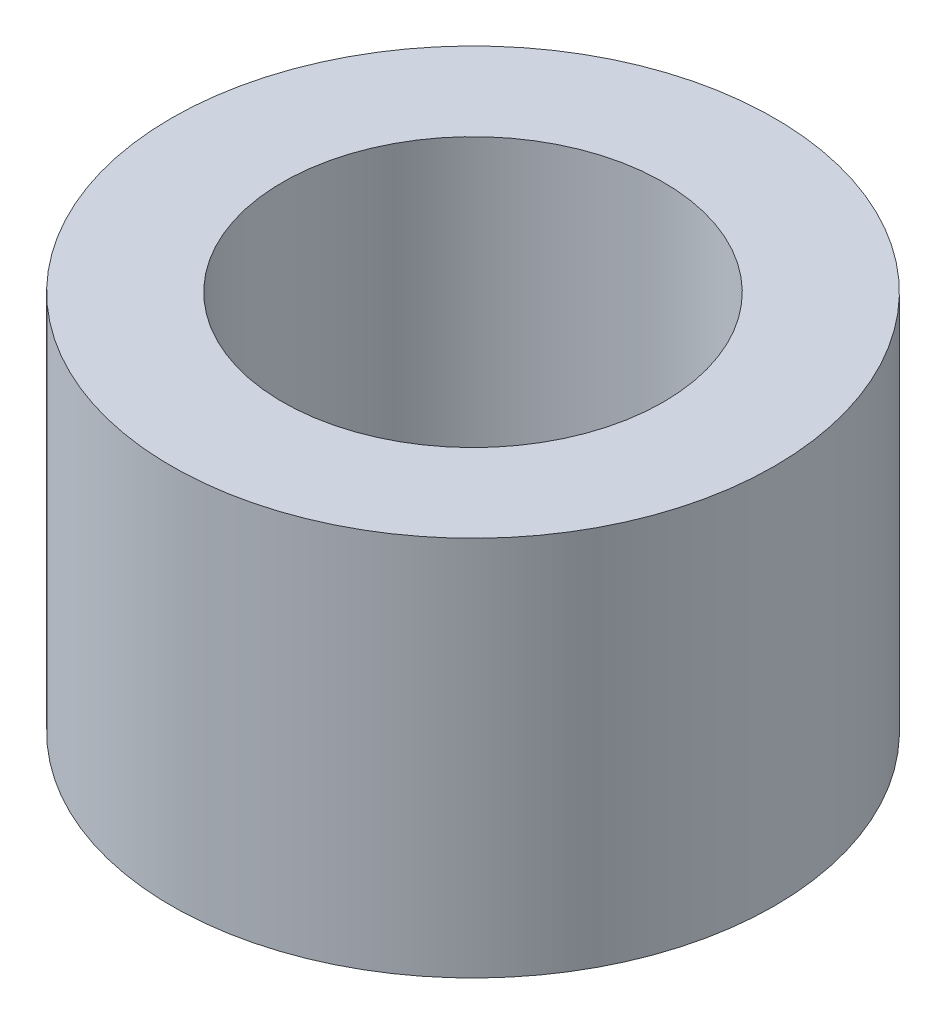
ISO-10303-21;
HEADER;
FILE_DESCRIPTION(('STEP AP214'),'2;1');
FILE_NAME('part.step','',(''),(''),'','','');
FILE_SCHEMA(('AUTOMOTIVE_DESIGN { 1 0 10303 214 1 1 1 1 }'));
ENDSEC;
DATA;
#1=APPLICATION_CONTEXT('core data for automotive mechanical design processes');
#2=APPLICATION_PROTOCOL_DEFINITION('international standard','automotive_design',2000,#1);
#3=PRODUCT_CONTEXT('',#1,'mechanical');
#4=PRODUCT('Part','Part','',(#3));
#5=PRODUCT_RELATED_PRODUCT_CATEGORY('part','',(#4));
#6=PRODUCT_DEFINITION_FORMATION('','',#4);
#7=PRODUCT_DEFINITION_CONTEXT('part definition',#1,'design');
#8=PRODUCT_DEFINITION('design','',#6,#7);
#9=PRODUCT_DEFINITION_SHAPE('','',#8);
#10=(LENGTH_UNIT() NAMED_UNIT(*) SI_UNIT(.MILLI.,.METRE.));
#11=(NAMED_UNIT(*) PLANE_ANGLE_UNIT() SI_UNIT($,.RADIAN.));
#12=(NAMED_UNIT(*) SI_UNIT($,.STERADIAN.) SOLID_ANGLE_UNIT());
#13=UNCERTAINTY_MEASURE_WITH_UNIT(LENGTH_MEASURE(1.E-05),#10,'distance_accuracy_value','');
#14=(GEOMETRIC_REPRESENTATION_CONTEXT(3) GLOBAL_UNCERTAINTY_ASSIGNED_CONTEXT((#13)) GLOBAL_UNIT_ASSIGNED_CONTEXT((#10,
#11,#12)) REPRESENTATION_CONTEXT('',''));
#15=CARTESIAN_POINT('',(0.,0.,0.));
#16=DIRECTION('',(0.,0.,1.));
#17=DIRECTION('',(1.,0.,0.));
#18=AXIS2_PLACEMENT_3D('',#15,#16,#17);
#19=CARTESIAN_POINT('',(0.,10.4,0.));
#20=DIRECTION('',(0.,1.,0.));
#21=DIRECTION('',(1.,0.,0.));
#22=AXIS2_PLACEMENT_3D('',#19,#20,#21);
#23=PLANE('',#22);
#24=CARTESIAN_POINT('',(0.,10.4,0.));
#25=DIRECTION('',(0.,1.,0.));
#26=DIRECTION('',(-1.,0.,0.));
#27=AXIS2_PLACEMENT_3D('',#24,#25,#26);
#28=CIRCLE('',#27,3.);
#29=CARTESIAN_POINT('',(3.,10.4,0.));
#30=VERTEX_POINT('',#29);
#31=EDGE_CURVE('E57',#30,#30,#28,.T.);
#32=ORIENTED_EDGE('',*,*,#31,.T.);
#33=EDGE_LOOP('',(#32));
#34=FACE_BOUND('',#33,.T.);
#35=CARTESIAN_POINT('',(0.,10.4,0.));
#36=DIRECTION('',(0.,-1.,0.));
#37=DIRECTION('',(-1.,0.,0.));
#38=AXIS2_PLACEMENT_3D('',#35,#36,#37);
#39=CIRCLE('',#38,4.75);
#40=CARTESIAN_POINT('',(4.75,10.4,0.));
#41=VERTEX_POINT('',#40);
#42=EDGE_CURVE('E67',#41,#41,#39,.T.);
#43=ORIENTED_EDGE('',*,*,#42,.T.);
#44=EDGE_LOOP('',(#43));
#45=FACE_BOUND('',#44,.T.);
#46=ADVANCED_FACE('F15',(#34,#45),#23,.F.);
#47=CARTESIAN_POINT('',(0.,16.4,0.));
#48=DIRECTION('',(0.,1.,0.));
#49=DIRECTION('',(1.,0.,0.));
#50=AXIS2_PLACEMENT_3D('',#47,#48,#49);
#51=PLANE('',#50);
#52=CARTESIAN_POINT('',(0.,16.4,0.));
#53=DIRECTION('',(0.,-1.,0.));
#54=DIRECTION('',(-1.,0.,0.));
#55=AXIS2_PLACEMENT_3D('',#52,#53,#54);
#56=CIRCLE('',#55,3.);
#57=CARTESIAN_POINT('',(3.,16.4,0.));
#58=VERTEX_POINT('',#57);
#59=EDGE_CURVE('E58',#58,#58,#56,.T.);
#60=ORIENTED_EDGE('',*,*,#59,.T.);
#61=EDGE_LOOP('',(#60));
#62=FACE_BOUND('',#61,.T.);
#63=CARTESIAN_POINT('',(0.,16.4,0.));
#64=DIRECTION('',(0.,1.,0.));
#65=DIRECTION('',(-1.,0.,0.));
#66=AXIS2_PLACEMENT_3D('',#63,#64,#65);
#67=CIRCLE('',#66,4.75);
#68=CARTESIAN_POINT('',(4.75,16.4,0.));
#69=VERTEX_POINT('',#68);
#70=EDGE_CURVE('E10',#69,#69,#67,.T.);
#71=ORIENTED_EDGE('',*,*,#70,.T.);
#72=EDGE_LOOP('',(#71));
#73=FACE_BOUND('',#72,.T.);
#74=ADVANCED_FACE('F17',(#62,#73),#51,.T.);
#75=CARTESIAN_POINT('',(0.,16.4,0.));
#76=DIRECTION('',(0.,-1.,0.));
#77=DIRECTION('',(-1.,0.,0.));
#78=AXIS2_PLACEMENT_3D('',#75,#76,#77);
#79=CYLINDRICAL_SURFACE('',#78,4.75);
#80=ORIENTED_EDGE('',*,*,#42,.F.);
#81=DIRECTION('',(0.,1.,0.));
#82=VECTOR('',#81,1.);
#83=CARTESIAN_POINT('',(4.75,16.4,0.));
#84=LINE('',#83,#82);
#85=EDGE_CURVE('E19',#41,#69,#84,.T.);
#86=ORIENTED_EDGE('',*,*,#85,.T.);
#87=ORIENTED_EDGE('',*,*,#70,.F.);
#88=ORIENTED_EDGE('',*,*,#85,.F.);
#89=EDGE_LOOP('',(#80,#86,#87,#88));
#90=FACE_BOUND('',#89,.T.);
#91=ADVANCED_FACE('F74',(#90),#79,.T.);
#92=CARTESIAN_POINT('',(0.,16.4,0.));
#93=DIRECTION('',(0.,-1.,0.));
#94=DIRECTION('',(-1.,0.,0.));
#95=AXIS2_PLACEMENT_3D('',#92,#93,#94);
#96=CYLINDRICAL_SURFACE('',#95,3.);
#97=ORIENTED_EDGE('',*,*,#31,.F.);
#98=DIRECTION('',(0.,1.,0.));
#99=VECTOR('',#98,1.);
#100=CARTESIAN_POINT('',(3.,16.4,0.));
#101=LINE('',#100,#99);
#102=EDGE_CURVE('E54',#30,#58,#101,.T.);
#103=ORIENTED_EDGE('',*,*,#102,.T.);
#104=ORIENTED_EDGE('',*,*,#59,.F.);
#105=ORIENTED_EDGE('',*,*,#102,.F.);
#106=EDGE_LOOP('',(#97,#103,#104,#105));
#107=FACE_BOUND('',#106,.T.);
#108=ADVANCED_FACE('F56',(#107),#96,.F.);
#109=CLOSED_SHELL('',(#46,#74,#91,#108));
#110=MANIFOLD_SOLID_BREP('B1',#109);
#111=ADVANCED_BREP_SHAPE_REPRESENTATION('',(#18,#110),#14);
#112=SHAPE_DEFINITION_REPRESENTATION(#9,#111);
ENDSEC;
END-ISO-10303-21;
